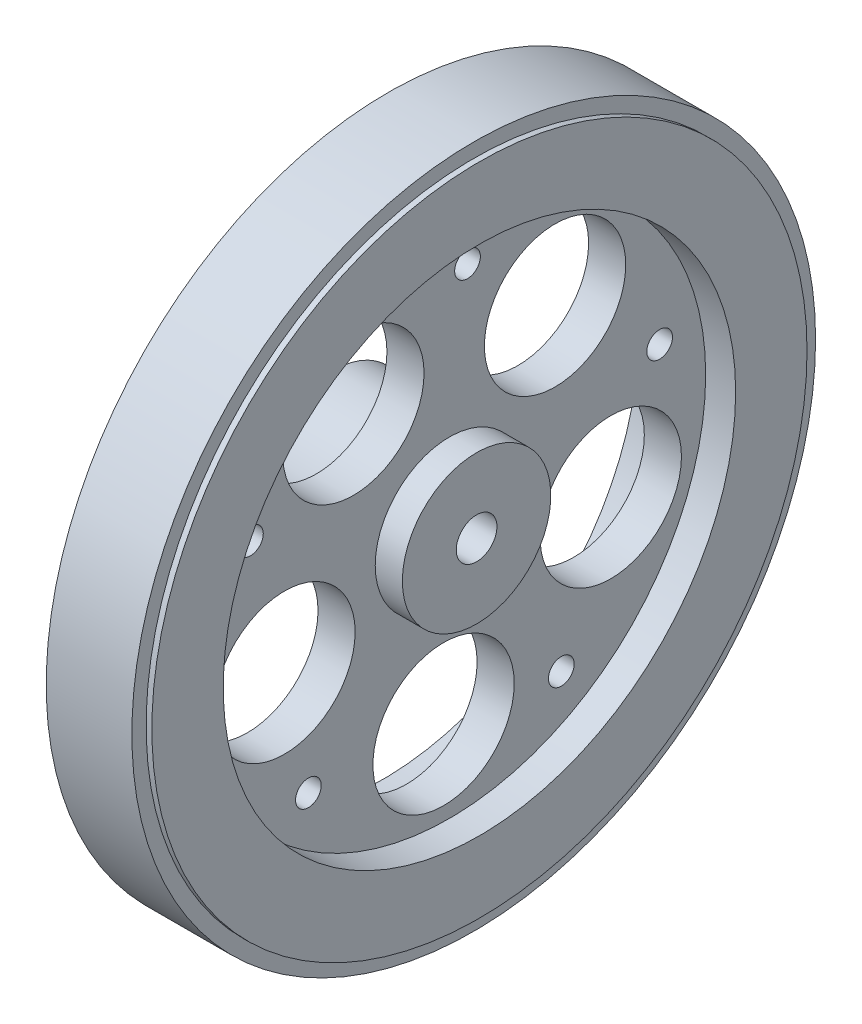
ISO-10303-21;
HEADER;
FILE_DESCRIPTION(('STEP AP214'),'2;1');
FILE_NAME('part.step','',(''),(''),'','','');
FILE_SCHEMA(('AUTOMOTIVE_DESIGN { 1 0 10303 214 1 1 1 1 }'));
ENDSEC;
DATA;
#1=APPLICATION_CONTEXT('core data for automotive mechanical design processes');
#2=APPLICATION_PROTOCOL_DEFINITION('international standard','automotive_design',2000,#1);
#3=PRODUCT_CONTEXT('',#1,'mechanical');
#4=PRODUCT('Part','Part','',(#3));
#5=PRODUCT_RELATED_PRODUCT_CATEGORY('part','',(#4));
#6=PRODUCT_DEFINITION_FORMATION('','',#4);
#7=PRODUCT_DEFINITION_CONTEXT('part definition',#1,'design');
#8=PRODUCT_DEFINITION('design','',#6,#7);
#9=PRODUCT_DEFINITION_SHAPE('','',#8);
#10=(LENGTH_UNIT() NAMED_UNIT(*) SI_UNIT(.MILLI.,.METRE.));
#11=(NAMED_UNIT(*) PLANE_ANGLE_UNIT() SI_UNIT($,.RADIAN.));
#12=(NAMED_UNIT(*) SI_UNIT($,.STERADIAN.) SOLID_ANGLE_UNIT());
#13=UNCERTAINTY_MEASURE_WITH_UNIT(LENGTH_MEASURE(1.E-05),#10,'distance_accuracy_value','');
#14=(GEOMETRIC_REPRESENTATION_CONTEXT(3) GLOBAL_UNCERTAINTY_ASSIGNED_CONTEXT((#13)) GLOBAL_UNIT_ASSIGNED_CONTEXT((#10,
#11,#12)) REPRESENTATION_CONTEXT('',''));
#15=CARTESIAN_POINT('',(0.,0.,0.));
#16=DIRECTION('',(0.,0.,1.));
#17=DIRECTION('',(1.,0.,0.));
#18=AXIS2_PLACEMENT_3D('',#15,#16,#17);
#19=CARTESIAN_POINT('',(2.6,0.,0.));
#20=DIRECTION('',(-1.,0.,0.));
#21=DIRECTION('',(0.,0.,1.));
#22=AXIS2_PLACEMENT_3D('',#19,#20,#21);
#23=CYLINDRICAL_SURFACE('',#22,45.9);
#24=CARTESIAN_POINT('',(-6.8,0.,0.));
#25=DIRECTION('',(1.,0.,0.));
#26=DIRECTION('',(0.,0.,-1.));
#27=AXIS2_PLACEMENT_3D('',#24,#25,#26);
#28=CIRCLE('',#27,45.9);
#29=CARTESIAN_POINT('',(-6.8,0.,-45.9));
#30=VERTEX_POINT('',#29);
#31=EDGE_CURVE('E149',#30,#30,#28,.T.);
#32=ORIENTED_EDGE('',*,*,#31,.T.);
#33=EDGE_LOOP('',(#32));
#34=FACE_BOUND('',#33,.T.);
#35=CARTESIAN_POINT('',(-6.,0.,0.));
#36=DIRECTION('',(1.,0.,0.));
#37=DIRECTION('',(0.,0.,-1.));
#38=AXIS2_PLACEMENT_3D('',#35,#36,#37);
#39=CIRCLE('',#38,45.9);
#40=CARTESIAN_POINT('',(-6.,0.,-45.9));
#41=VERTEX_POINT('',#40);
#42=EDGE_CURVE('E10',#41,#41,#39,.T.);
#43=ORIENTED_EDGE('',*,*,#42,.F.);
#44=EDGE_LOOP('',(#43));
#45=FACE_BOUND('',#44,.T.);
#46=ADVANCED_FACE('F39',(#34,#45),#23,.T.);
#47=CARTESIAN_POINT('',(2.6,0.,0.));
#48=DIRECTION('',(1.,0.,0.));
#49=DIRECTION('',(0.,0.,-1.));
#50=AXIS2_PLACEMENT_3D('',#47,#48,#49);
#51=PLANE('',#50);
#52=CARTESIAN_POINT('',(2.6,30.1440823798759,-2.52918909440491));
#53=DIRECTION('',(1.,0.,0.));
#54=DIRECTION('',(0.,0.,-1.));
#55=AXIS2_PLACEMENT_3D('',#52,#53,#54);
#56=CIRCLE('',#55,1.8);
#57=CARTESIAN_POINT('',(2.6,30.1440823798759,-4.32918909440491));
#58=VERTEX_POINT('',#57);
#59=EDGE_CURVE('E94',#58,#58,#56,.T.);
#60=ORIENTED_EDGE('',*,*,#59,.F.);
#61=EDGE_LOOP('',(#60));
#62=FACE_BOUND('',#61,.T.);
#63=CARTESIAN_POINT('',(2.6,6.90963196604355,-29.4502883872778));
#64=DIRECTION('',(1.,0.,0.));
#65=DIRECTION('',(0.,0.,-1.));
#66=AXIS2_PLACEMENT_3D('',#63,#64,#65);
#67=CIRCLE('',#66,1.8);
#68=CARTESIAN_POINT('',(2.6,6.90963196604355,-31.2502883872778));
#69=VERTEX_POINT('',#68);
#70=EDGE_CURVE('E91',#69,#69,#67,.T.);
#71=ORIENTED_EDGE('',*,*,#70,.F.);
#72=EDGE_LOOP('',(#71));
#73=FACE_BOUND('',#72,.T.);
#74=CARTESIAN_POINT('',(2.6,-25.8736949751082,-15.6720901074189));
#75=DIRECTION('',(1.,0.,0.));
#76=DIRECTION('',(0.,0.,-1.));
#77=AXIS2_PLACEMENT_3D('',#74,#75,#76);
#78=CIRCLE('',#77,1.8);
#79=CARTESIAN_POINT('',(2.6,-25.8736949751082,-17.4720901074189));
#80=VERTEX_POINT('',#79);
#81=EDGE_CURVE('E87',#80,#80,#78,.T.);
#82=ORIENTED_EDGE('',*,*,#81,.F.);
#83=EDGE_LOOP('',(#82));
#84=FACE_BOUND('',#83,.T.);
#85=CARTESIAN_POINT('',(2.6,-22.9004548752077,19.764404026142));
#86=DIRECTION('',(1.,0.,0.));
#87=DIRECTION('',(0.,0.,-1.));
#88=AXIS2_PLACEMENT_3D('',#85,#86,#87);
#89=CIRCLE('',#88,1.8);
#90=CARTESIAN_POINT('',(2.6,-22.9004548752077,17.964404026142));
#91=VERTEX_POINT('',#90);
#92=EDGE_CURVE('E83',#91,#91,#89,.T.);
#93=ORIENTED_EDGE('',*,*,#92,.F.);
#94=EDGE_LOOP('',(#93));
#95=FACE_BOUND('',#94,.T.);
#96=CARTESIAN_POINT('',(2.6,11.7204355043968,27.8871635629598));
#97=DIRECTION('',(1.,0.,0.));
#98=DIRECTION('',(0.,0.,-1.));
#99=AXIS2_PLACEMENT_3D('',#96,#97,#98);
#100=CIRCLE('',#99,1.8);
#101=CARTESIAN_POINT('',(2.6,11.7204355043968,26.0871635629598));
#102=VERTEX_POINT('',#101);
#103=EDGE_CURVE('E79',#102,#102,#100,.T.);
#104=ORIENTED_EDGE('',*,*,#103,.F.);
#105=EDGE_LOOP('',(#104));
#106=FACE_BOUND('',#105,.T.);
#107=CARTESIAN_POINT('',(2.6,-6.64204065665267,23.1146229888219));
#108=DIRECTION('',(1.,0.,0.));
#109=DIRECTION('',(0.,0.,-1.));
#110=AXIS2_PLACEMENT_3D('',#107,#108,#109);
#111=CIRCLE('',#110,9.9);
#112=CARTESIAN_POINT('',(2.6,-6.64204065665267,13.2146229888219));
#113=VERTEX_POINT('',#112);
#114=EDGE_CURVE('E75',#113,#113,#111,.T.);
#115=ORIENTED_EDGE('',*,*,#114,.F.);
#116=EDGE_LOOP('',(#115));
#117=FACE_BOUND('',#116,.T.);
#118=CARTESIAN_POINT('',(2.6,-24.0358162554598,0.825855274108885));
#119=DIRECTION('',(1.,0.,0.));
#120=DIRECTION('',(0.,0.,-1.));
#121=AXIS2_PLACEMENT_3D('',#118,#119,#120);
#122=CIRCLE('',#121,9.9);
#123=CARTESIAN_POINT('',(2.6,-24.0358162554598,-9.07414472589112));
#124=VERTEX_POINT('',#123);
#125=EDGE_CURVE('E71',#124,#124,#122,.T.);
#126=ORIENTED_EDGE('',*,*,#125,.F.);
#127=EDGE_LOOP('',(#126));
#128=FACE_BOUND('',#127,.T.);
#129=CARTESIAN_POINT('',(2.6,-8.2129107365686,-22.6042163596342));
#130=DIRECTION('',(1.,0.,0.));
#131=DIRECTION('',(0.,0.,-1.));
#132=AXIS2_PLACEMENT_3D('',#129,#130,#131);
#133=CIRCLE('',#132,9.9);
#134=CARTESIAN_POINT('',(2.6,-8.2129107365686,-32.5042163596342));
#135=VERTEX_POINT('',#134);
#136=EDGE_CURVE('E67',#135,#135,#133,.T.);
#137=ORIENTED_EDGE('',*,*,#136,.F.);
#138=EDGE_LOOP('',(#137));
#139=FACE_BOUND('',#138,.T.);
#140=CARTESIAN_POINT('',(2.6,18.9599582736915,-14.7960292734191));
#141=DIRECTION('',(1.,0.,0.));
#142=DIRECTION('',(0.,0.,-1.));
#143=AXIS2_PLACEMENT_3D('',#140,#141,#142);
#144=CIRCLE('',#143,9.9);
#145=CARTESIAN_POINT('',(2.6,18.9599582736915,-24.6960292734191));
#146=VERTEX_POINT('',#145);
#147=EDGE_CURVE('E63',#146,#146,#144,.T.);
#148=ORIENTED_EDGE('',*,*,#147,.F.);
#149=EDGE_LOOP('',(#148));
#150=FACE_BOUND('',#149,.T.);
#151=CARTESIAN_POINT('',(2.6,19.9308093749896,13.4597673701229));
#152=DIRECTION('',(1.,0.,0.));
#153=DIRECTION('',(0.,0.,-1.));
#154=AXIS2_PLACEMENT_3D('',#151,#152,#153);
#155=CIRCLE('',#154,9.9);
#156=CARTESIAN_POINT('',(2.6,19.9308093749896,3.55976737012288));
#157=VERTEX_POINT('',#156);
#158=EDGE_CURVE('E62',#157,#157,#155,.T.);
#159=ORIENTED_EDGE('',*,*,#158,.F.);
#160=EDGE_LOOP('',(#159));
#161=FACE_BOUND('',#160,.T.);
#162=CARTESIAN_POINT('',(2.6,0.,0.));
#163=DIRECTION('',(1.,0.,0.));
#164=DIRECTION('',(0.,0.,-1.));
#165=AXIS2_PLACEMENT_3D('',#162,#163,#164);
#166=CIRCLE('',#165,35.9);
#167=CARTESIAN_POINT('',(2.6,0.,-35.9));
#168=VERTEX_POINT('',#167);
#169=EDGE_CURVE('E50',#168,#168,#166,.F.);
#170=ORIENTED_EDGE('',*,*,#169,.F.);
#171=EDGE_LOOP('',(#170));
#172=FACE_BOUND('',#171,.T.);
#173=CARTESIAN_POINT('',(2.6,0.,0.));
#174=DIRECTION('',(1.,0.,0.));
#175=DIRECTION('',(0.,0.,-1.));
#176=AXIS2_PLACEMENT_3D('',#173,#174,#175);
#177=CIRCLE('',#176,10.4);
#178=CARTESIAN_POINT('',(2.6,0.,10.4));
#179=VERTEX_POINT('',#178);
#180=EDGE_CURVE('E133',#179,#179,#177,.T.);
#181=ORIENTED_EDGE('',*,*,#180,.F.);
#182=EDGE_LOOP('',(#181));
#183=FACE_BOUND('',#182,.T.);
#184=ADVANCED_FACE('F179',(#62,#73,#84,#95,#106,#117,#128,#139,#150,#161,#172,#183),#51,.T.);
#185=CARTESIAN_POINT('',(-2.6,0.,0.));
#186=DIRECTION('',(1.,0.,0.));
#187=DIRECTION('',(0.,0.,-1.));
#188=AXIS2_PLACEMENT_3D('',#185,#186,#187);
#189=PLANE('',#188);
#190=CARTESIAN_POINT('',(-2.6,30.1440823798759,-2.52918909440491));
#191=DIRECTION('',(1.,0.,0.));
#192=DIRECTION('',(0.,0.,-1.));
#193=AXIS2_PLACEMENT_3D('',#190,#191,#192);
#194=CIRCLE('',#193,1.8);
#195=CARTESIAN_POINT('',(-2.6,30.1440823798759,-4.32918909440491));
#196=VERTEX_POINT('',#195);
#197=EDGE_CURVE('E95',#196,#196,#194,.T.);
#198=ORIENTED_EDGE('',*,*,#197,.T.);
#199=EDGE_LOOP('',(#198));
#200=FACE_BOUND('',#199,.T.);
#201=CARTESIAN_POINT('',(-2.6,6.90963196604355,-29.4502883872778));
#202=DIRECTION('',(1.,0.,0.));
#203=DIRECTION('',(0.,0.,-1.));
#204=AXIS2_PLACEMENT_3D('',#201,#202,#203);
#205=CIRCLE('',#204,1.8);
#206=CARTESIAN_POINT('',(-2.6,6.90963196604355,-31.2502883872778));
#207=VERTEX_POINT('',#206);
#208=EDGE_CURVE('E92',#207,#207,#205,.T.);
#209=ORIENTED_EDGE('',*,*,#208,.T.);
#210=EDGE_LOOP('',(#209));
#211=FACE_BOUND('',#210,.T.);
#212=CARTESIAN_POINT('',(-2.6,-25.8736949751082,-15.6720901074189));
#213=DIRECTION('',(1.,0.,0.));
#214=DIRECTION('',(0.,0.,-1.));
#215=AXIS2_PLACEMENT_3D('',#212,#213,#214);
#216=CIRCLE('',#215,1.8);
#217=CARTESIAN_POINT('',(-2.6,-25.8736949751082,-17.4720901074189));
#218=VERTEX_POINT('',#217);
#219=EDGE_CURVE('E88',#218,#218,#216,.T.);
#220=ORIENTED_EDGE('',*,*,#219,.T.);
#221=EDGE_LOOP('',(#220));
#222=FACE_BOUND('',#221,.T.);
#223=CARTESIAN_POINT('',(-2.6,-22.9004548752077,19.764404026142));
#224=DIRECTION('',(1.,0.,0.));
#225=DIRECTION('',(0.,0.,-1.));
#226=AXIS2_PLACEMENT_3D('',#223,#224,#225);
#227=CIRCLE('',#226,1.8);
#228=CARTESIAN_POINT('',(-2.6,-22.9004548752077,17.964404026142));
#229=VERTEX_POINT('',#228);
#230=EDGE_CURVE('E84',#229,#229,#227,.T.);
#231=ORIENTED_EDGE('',*,*,#230,.T.);
#232=EDGE_LOOP('',(#231));
#233=FACE_BOUND('',#232,.T.);
#234=CARTESIAN_POINT('',(-2.6,11.7204355043968,27.8871635629598));
#235=DIRECTION('',(1.,0.,0.));
#236=DIRECTION('',(0.,0.,-1.));
#237=AXIS2_PLACEMENT_3D('',#234,#235,#236);
#238=CIRCLE('',#237,1.8);
#239=CARTESIAN_POINT('',(-2.6,11.7204355043968,26.0871635629598));
#240=VERTEX_POINT('',#239);
#241=EDGE_CURVE('E80',#240,#240,#238,.T.);
#242=ORIENTED_EDGE('',*,*,#241,.T.);
#243=EDGE_LOOP('',(#242));
#244=FACE_BOUND('',#243,.T.);
#245=CARTESIAN_POINT('',(-2.6,-6.64204065665267,23.1146229888219));
#246=DIRECTION('',(1.,0.,0.));
#247=DIRECTION('',(0.,0.,-1.));
#248=AXIS2_PLACEMENT_3D('',#245,#246,#247);
#249=CIRCLE('',#248,9.9);
#250=CARTESIAN_POINT('',(-2.6,-6.64204065665267,13.2146229888219));
#251=VERTEX_POINT('',#250);
#252=EDGE_CURVE('E76',#251,#251,#249,.T.);
#253=ORIENTED_EDGE('',*,*,#252,.T.);
#254=EDGE_LOOP('',(#253));
#255=FACE_BOUND('',#254,.T.);
#256=CARTESIAN_POINT('',(-2.6,-24.0358162554598,0.825855274108885));
#257=DIRECTION('',(1.,0.,0.));
#258=DIRECTION('',(0.,0.,-1.));
#259=AXIS2_PLACEMENT_3D('',#256,#257,#258);
#260=CIRCLE('',#259,9.9);
#261=CARTESIAN_POINT('',(-2.6,-24.0358162554598,-9.07414472589112));
#262=VERTEX_POINT('',#261);
#263=EDGE_CURVE('E72',#262,#262,#260,.T.);
#264=ORIENTED_EDGE('',*,*,#263,.T.);
#265=EDGE_LOOP('',(#264));
#266=FACE_BOUND('',#265,.T.);
#267=CARTESIAN_POINT('',(-2.6,-8.2129107365686,-22.6042163596342));
#268=DIRECTION('',(1.,0.,0.));
#269=DIRECTION('',(0.,0.,-1.));
#270=AXIS2_PLACEMENT_3D('',#267,#268,#269);
#271=CIRCLE('',#270,9.9);
#272=CARTESIAN_POINT('',(-2.6,-8.2129107365686,-32.5042163596342));
#273=VERTEX_POINT('',#272);
#274=EDGE_CURVE('E68',#273,#273,#271,.T.);
#275=ORIENTED_EDGE('',*,*,#274,.T.);
#276=EDGE_LOOP('',(#275));
#277=FACE_BOUND('',#276,.T.);
#278=CARTESIAN_POINT('',(-2.6,18.9599582736915,-14.7960292734191));
#279=DIRECTION('',(1.,0.,0.));
#280=DIRECTION('',(0.,0.,-1.));
#281=AXIS2_PLACEMENT_3D('',#278,#279,#280);
#282=CIRCLE('',#281,9.9);
#283=CARTESIAN_POINT('',(-2.6,18.9599582736915,-24.6960292734191));
#284=VERTEX_POINT('',#283);
#285=EDGE_CURVE('E64',#284,#284,#282,.T.);
#286=ORIENTED_EDGE('',*,*,#285,.T.);
#287=EDGE_LOOP('',(#286));
#288=FACE_BOUND('',#287,.T.);
#289=CARTESIAN_POINT('',(-2.6,19.9308093749896,13.4597673701229));
#290=DIRECTION('',(1.,0.,0.));
#291=DIRECTION('',(0.,0.,-1.));
#292=AXIS2_PLACEMENT_3D('',#289,#290,#291);
#293=CIRCLE('',#292,9.9);
#294=CARTESIAN_POINT('',(-2.6,19.9308093749896,3.55976737012288));
#295=VERTEX_POINT('',#294);
#296=EDGE_CURVE('E59',#295,#295,#293,.T.);
#297=ORIENTED_EDGE('',*,*,#296,.T.);
#298=EDGE_LOOP('',(#297));
#299=FACE_BOUND('',#298,.T.);
#300=CARTESIAN_POINT('',(-2.6,0.,0.));
#301=DIRECTION('',(1.,0.,0.));
#302=DIRECTION('',(0.,0.,-1.));
#303=AXIS2_PLACEMENT_3D('',#300,#301,#302);
#304=CIRCLE('',#303,35.9);
#305=CARTESIAN_POINT('',(-2.6,0.,-35.9));
#306=VERTEX_POINT('',#305);
#307=EDGE_CURVE('E55',#306,#306,#304,.F.);
#308=ORIENTED_EDGE('',*,*,#307,.T.);
#309=EDGE_LOOP('',(#308));
#310=FACE_BOUND('',#309,.T.);
#311=CARTESIAN_POINT('',(-2.6,0.,0.));
#312=DIRECTION('',(1.,0.,0.));
#313=DIRECTION('',(0.,0.,-1.));
#314=AXIS2_PLACEMENT_3D('',#311,#312,#313);
#315=CIRCLE('',#314,10.4);
#316=CARTESIAN_POINT('',(-2.6,0.,-10.4));
#317=VERTEX_POINT('',#316);
#318=EDGE_CURVE('E46',#317,#317,#315,.F.);
#319=ORIENTED_EDGE('',*,*,#318,.F.);
#320=EDGE_LOOP('',(#319));
#321=FACE_BOUND('',#320,.T.);
#322=ADVANCED_FACE('F175',(#200,#211,#222,#233,#244,#255,#266,#277,#288,#299,#310,#321),#189,.F.);
#323=CARTESIAN_POINT('',(6.8,0.,0.));
#324=DIRECTION('',(1.,0.,0.));
#325=DIRECTION('',(0.,0.,-1.));
#326=AXIS2_PLACEMENT_3D('',#323,#324,#325);
#327=PLANE('',#326);
#328=CARTESIAN_POINT('',(6.8,0.,0.));
#329=DIRECTION('',(1.,0.,0.));
#330=DIRECTION('',(0.,0.,-1.));
#331=AXIS2_PLACEMENT_3D('',#328,#329,#330);
#332=CIRCLE('',#331,45.9);
#333=CARTESIAN_POINT('',(6.8,0.,-45.9));
#334=VERTEX_POINT('',#333);
#335=EDGE_CURVE('E152',#334,#334,#332,.T.);
#336=ORIENTED_EDGE('',*,*,#335,.T.);
#337=EDGE_LOOP('',(#336));
#338=FACE_BOUND('',#337,.T.);
#339=CARTESIAN_POINT('',(6.8,0.,0.));
#340=DIRECTION('',(1.,0.,0.));
#341=DIRECTION('',(0.,0.,-1.));
#342=AXIS2_PLACEMENT_3D('',#339,#340,#341);
#343=CIRCLE('',#342,35.9);
#344=CARTESIAN_POINT('',(6.8,0.,-35.9));
#345=VERTEX_POINT('',#344);
#346=EDGE_CURVE('E146',#345,#345,#343,.T.);
#347=ORIENTED_EDGE('',*,*,#346,.F.);
#348=EDGE_LOOP('',(#347));
#349=FACE_BOUND('',#348,.T.);
#350=ADVANCED_FACE('F178',(#338,#349),#327,.T.);
#351=CARTESIAN_POINT('',(6.8,0.,0.));
#352=DIRECTION('',(-1.,0.,0.));
#353=DIRECTION('',(0.,0.,1.));
#354=AXIS2_PLACEMENT_3D('',#351,#352,#353);
#355=CYLINDRICAL_SURFACE('',#354,35.9);
#356=ORIENTED_EDGE('',*,*,#169,.T.);
#357=EDGE_LOOP('',(#356));
#358=FACE_BOUND('',#357,.T.);
#359=ORIENTED_EDGE('',*,*,#346,.T.);
#360=EDGE_LOOP('',(#359));
#361=FACE_BOUND('',#360,.T.);
#362=ADVANCED_FACE('F171',(#358,#361),#355,.F.);
#363=CARTESIAN_POINT('',(6.,0.,0.));
#364=DIRECTION('',(1.,0.,0.));
#365=DIRECTION('',(0.,0.,-1.));
#366=AXIS2_PLACEMENT_3D('',#363,#364,#365);
#367=CIRCLE('',#366,45.9);
#368=CARTESIAN_POINT('',(6.,0.,-45.9));
#369=VERTEX_POINT('',#368);
#370=EDGE_CURVE('E108',#369,#369,#367,.T.);
#371=ORIENTED_EDGE('',*,*,#370,.T.);
#372=EDGE_LOOP('',(#371));
#373=FACE_BOUND('',#372,.T.);
#374=ORIENTED_EDGE('',*,*,#335,.F.);
#375=EDGE_LOOP('',(#374));
#376=FACE_BOUND('',#375,.T.);
#377=ADVANCED_FACE('F41',(#373,#376),#23,.T.);
#378=CARTESIAN_POINT('',(-6.8,0.,0.));
#379=DIRECTION('',(1.,0.,0.));
#380=DIRECTION('',(0.,0.,-1.));
#381=AXIS2_PLACEMENT_3D('',#378,#379,#380);
#382=PLANE('',#381);
#383=ORIENTED_EDGE('',*,*,#31,.F.);
#384=EDGE_LOOP('',(#383));
#385=FACE_BOUND('',#384,.T.);
#386=CARTESIAN_POINT('',(-6.8,0.,0.));
#387=DIRECTION('',(1.,0.,0.));
#388=DIRECTION('',(0.,0.,-1.));
#389=AXIS2_PLACEMENT_3D('',#386,#387,#388);
#390=CIRCLE('',#389,35.9);
#391=CARTESIAN_POINT('',(-6.8,0.,-35.9));
#392=VERTEX_POINT('',#391);
#393=EDGE_CURVE('E145',#392,#392,#390,.T.);
#394=ORIENTED_EDGE('',*,*,#393,.T.);
#395=EDGE_LOOP('',(#394));
#396=FACE_BOUND('',#395,.T.);
#397=ADVANCED_FACE('F160',(#385,#396),#382,.F.);
#398=ORIENTED_EDGE('',*,*,#393,.F.);
#399=EDGE_LOOP('',(#398));
#400=FACE_BOUND('',#399,.T.);
#401=ORIENTED_EDGE('',*,*,#307,.F.);
#402=EDGE_LOOP('',(#401));
#403=FACE_BOUND('',#402,.T.);
#404=ADVANCED_FACE('F163',(#400,#403),#355,.F.);
#405=CARTESIAN_POINT('',(-6.8,0.,0.));
#406=DIRECTION('',(1.,0.,0.));
#407=DIRECTION('',(0.,0.,-1.));
#408=AXIS2_PLACEMENT_3D('',#405,#406,#407);
#409=CYLINDRICAL_SURFACE('',#408,2.85);
#410=CARTESIAN_POINT('',(-13.6,0.,0.));
#411=DIRECTION('',(-1.,0.,0.));
#412=DIRECTION('',(0.,0.,1.));
#413=AXIS2_PLACEMENT_3D('',#410,#411,#412);
#414=CIRCLE('',#413,2.85);
#415=CARTESIAN_POINT('',(-13.6,0.,2.85));
#416=VERTEX_POINT('',#415);
#417=EDGE_CURVE('E137',#416,#416,#414,.T.);
#418=ORIENTED_EDGE('',*,*,#417,.T.);
#419=EDGE_LOOP('',(#418));
#420=FACE_BOUND('',#419,.T.);
#421=CARTESIAN_POINT('',(6.4,0.,0.));
#422=DIRECTION('',(1.,0.,0.));
#423=DIRECTION('',(0.,0.,-1.));
#424=AXIS2_PLACEMENT_3D('',#421,#422,#423);
#425=CIRCLE('',#424,2.85);
#426=CARTESIAN_POINT('',(6.4,0.,-2.85));
#427=VERTEX_POINT('',#426);
#428=EDGE_CURVE('E130',#427,#427,#425,.T.);
#429=ORIENTED_EDGE('',*,*,#428,.T.);
#430=EDGE_LOOP('',(#429));
#431=FACE_BOUND('',#430,.T.);
#432=ADVANCED_FACE('F169',(#420,#431),#409,.F.);
#433=CARTESIAN_POINT('',(-13.6,0.,0.));
#434=DIRECTION('',(-1.,0.,0.));
#435=DIRECTION('',(0.,0.,1.));
#436=AXIS2_PLACEMENT_3D('',#433,#434,#435);
#437=PLANE('',#436);
#438=CARTESIAN_POINT('',(-13.6,0.,0.));
#439=DIRECTION('',(-1.,0.,0.));
#440=DIRECTION('',(0.,0.,1.));
#441=AXIS2_PLACEMENT_3D('',#438,#439,#440);
#442=CIRCLE('',#441,10.4);
#443=CARTESIAN_POINT('',(-13.6,0.,10.4));
#444=VERTEX_POINT('',#443);
#445=EDGE_CURVE('E142',#444,#444,#442,.T.);
#446=ORIENTED_EDGE('',*,*,#445,.T.);
#447=EDGE_LOOP('',(#446));
#448=FACE_BOUND('',#447,.T.);
#449=ORIENTED_EDGE('',*,*,#417,.F.);
#450=EDGE_LOOP('',(#449));
#451=FACE_BOUND('',#450,.T.);
#452=ADVANCED_FACE('F269',(#448,#451),#437,.T.);
#453=CARTESIAN_POINT('',(-13.6,0.,0.));
#454=DIRECTION('',(1.,0.,0.));
#455=DIRECTION('',(0.,0.,-1.));
#456=AXIS2_PLACEMENT_3D('',#453,#454,#455);
#457=CYLINDRICAL_SURFACE('',#456,10.4);
#458=ORIENTED_EDGE('',*,*,#445,.F.);
#459=EDGE_LOOP('',(#458));
#460=FACE_BOUND('',#459,.T.);
#461=ORIENTED_EDGE('',*,*,#318,.T.);
#462=EDGE_LOOP('',(#461));
#463=FACE_BOUND('',#462,.T.);
#464=ADVANCED_FACE('F264',(#460,#463),#457,.T.);
#465=CARTESIAN_POINT('',(6.4,0.,0.));
#466=DIRECTION('',(1.,0.,0.));
#467=DIRECTION('',(0.,0.,-1.));
#468=AXIS2_PLACEMENT_3D('',#465,#466,#467);
#469=PLANE('',#468);
#470=CARTESIAN_POINT('',(6.4,0.,0.));
#471=DIRECTION('',(1.,0.,0.));
#472=DIRECTION('',(0.,0.,-1.));
#473=AXIS2_PLACEMENT_3D('',#470,#471,#472);
#474=CIRCLE('',#473,10.4);
#475=CARTESIAN_POINT('',(6.4,0.,10.4));
#476=VERTEX_POINT('',#475);
#477=EDGE_CURVE('E134',#476,#476,#474,.T.);
#478=ORIENTED_EDGE('',*,*,#477,.T.);
#479=EDGE_LOOP('',(#478));
#480=FACE_BOUND('',#479,.T.);
#481=ORIENTED_EDGE('',*,*,#428,.F.);
#482=EDGE_LOOP('',(#481));
#483=FACE_BOUND('',#482,.T.);
#484=ADVANCED_FACE('F261',(#480,#483),#469,.T.);
#485=CARTESIAN_POINT('',(6.4,0.,0.));
#486=DIRECTION('',(-1.,0.,0.));
#487=DIRECTION('',(0.,0.,1.));
#488=AXIS2_PLACEMENT_3D('',#485,#486,#487);
#489=CYLINDRICAL_SURFACE('',#488,10.4);
#490=CARTESIAN_POINT('',(6.4,0.,10.4));
#491=CARTESIAN_POINT('',(6.36041666666667,0.,10.4));
#492=CARTESIAN_POINT('',(6.32083333333333,0.,10.4));
#493=CARTESIAN_POINT('',(6.24166666666667,0.,10.4));
#494=CARTESIAN_POINT('',(6.20208333333333,0.,10.4));
#495=CARTESIAN_POINT('',(6.12291666666667,0.,10.4));
#496=CARTESIAN_POINT('',(6.08333333333333,0.,10.4));
#497=CARTESIAN_POINT('',(6.00416666666667,0.,10.4));
#498=CARTESIAN_POINT('',(5.96458333333333,0.,10.4));
#499=CARTESIAN_POINT('',(5.88541666666667,0.,10.4));
#500=CARTESIAN_POINT('',(5.84583333333333,0.,10.4));
#501=CARTESIAN_POINT('',(5.76666666666667,0.,10.4));
#502=CARTESIAN_POINT('',(5.72708333333333,0.,10.4));
#503=CARTESIAN_POINT('',(5.64791666666667,0.,10.4));
#504=CARTESIAN_POINT('',(5.60833333333333,0.,10.4));
#505=CARTESIAN_POINT('',(5.52916666666667,0.,10.4));
#506=CARTESIAN_POINT('',(5.48958333333333,0.,10.4));
#507=CARTESIAN_POINT('',(5.41041666666667,0.,10.4));
#508=CARTESIAN_POINT('',(5.37083333333333,0.,10.4));
#509=CARTESIAN_POINT('',(5.29166666666667,0.,10.4));
#510=CARTESIAN_POINT('',(5.25208333333333,0.,10.4));
#511=CARTESIAN_POINT('',(5.17291666666667,0.,10.4));
#512=CARTESIAN_POINT('',(5.13333333333333,0.,10.4));
#513=CARTESIAN_POINT('',(5.05416666666667,0.,10.4));
#514=CARTESIAN_POINT('',(5.01458333333333,0.,10.4));
#515=CARTESIAN_POINT('',(4.93541666666667,0.,10.4));
#516=CARTESIAN_POINT('',(4.89583333333333,0.,10.4));
#517=CARTESIAN_POINT('',(4.81666666666667,0.,10.4));
#518=CARTESIAN_POINT('',(4.77708333333333,0.,10.4));
#519=CARTESIAN_POINT('',(4.69791666666667,0.,10.4));
#520=CARTESIAN_POINT('',(4.65833333333333,0.,10.4));
#521=CARTESIAN_POINT('',(4.57916666666667,0.,10.4));
#522=CARTESIAN_POINT('',(4.53958333333333,0.,10.4));
#523=CARTESIAN_POINT('',(4.46041666666667,0.,10.4));
#524=CARTESIAN_POINT('',(4.42083333333333,0.,10.4));
#525=CARTESIAN_POINT('',(4.34166666666667,0.,10.4));
#526=CARTESIAN_POINT('',(4.30208333333333,0.,10.4));
#527=CARTESIAN_POINT('',(4.22291666666667,0.,10.4));
#528=CARTESIAN_POINT('',(4.18333333333333,0.,10.4));
#529=CARTESIAN_POINT('',(4.10416666666667,0.,10.4));
#530=CARTESIAN_POINT('',(4.06458333333333,0.,10.4));
#531=CARTESIAN_POINT('',(3.98541666666667,0.,10.4));
#532=CARTESIAN_POINT('',(3.94583333333333,0.,10.4));
#533=CARTESIAN_POINT('',(3.86666666666667,0.,10.4));
#534=CARTESIAN_POINT('',(3.82708333333333,0.,10.4));
#535=CARTESIAN_POINT('',(3.74791666666667,0.,10.4));
#536=CARTESIAN_POINT('',(3.70833333333333,0.,10.4));
#537=CARTESIAN_POINT('',(3.62916666666667,0.,10.4));
#538=CARTESIAN_POINT('',(3.58958333333333,0.,10.4));
#539=CARTESIAN_POINT('',(3.51041666666667,0.,10.4));
#540=CARTESIAN_POINT('',(3.47083333333333,0.,10.4));
#541=CARTESIAN_POINT('',(3.39166666666667,0.,10.4));
#542=CARTESIAN_POINT('',(3.35208333333333,0.,10.4));
#543=CARTESIAN_POINT('',(3.27291666666667,0.,10.4));
#544=CARTESIAN_POINT('',(3.23333333333333,0.,10.4));
#545=CARTESIAN_POINT('',(3.15416666666667,0.,10.4));
#546=CARTESIAN_POINT('',(3.11458333333333,0.,10.4));
#547=CARTESIAN_POINT('',(3.03541666666667,0.,10.4));
#548=CARTESIAN_POINT('',(2.99583333333333,0.,10.4));
#549=CARTESIAN_POINT('',(2.91666666666667,0.,10.4));
#550=CARTESIAN_POINT('',(2.87708333333333,0.,10.4));
#551=CARTESIAN_POINT('',(2.79791666666667,0.,10.4));
#552=CARTESIAN_POINT('',(2.75833333333333,0.,10.4));
#553=CARTESIAN_POINT('',(2.67916666666667,0.,10.4));
#554=CARTESIAN_POINT('',(2.63958333333333,0.,10.4));
#555=CARTESIAN_POINT('',(2.6,0.,10.4));
#556=B_SPLINE_CURVE_WITH_KNOTS('',3,(#490,#491,#492,#493,#494,#495,#496,#497,#498,#499,#500,
#501,#502,#503,#504,#505,#506,#507,#508,#509,#510,#511,#512,#513,#514,#515,#516,#517,#518,#519,
#520,#521,#522,#523,#524,#525,#526,#527,#528,#529,#530,#531,#532,#533,#534,#535,#536,#537,#538,
#539,#540,#541,#542,#543,#544,#545,#546,#547,#548,#549,#550,#551,#552,#553,#554,#555),
.UNSPECIFIED.,.F.,.F.,(4,2,2,2,2,2,2,2,2,2,2,2,2,2,2,2,2,2,2,2,2,2,2,2,2,2,2,2,2,2,2,2,4),(0.,
0.118750000000001,0.237500000000001,0.356250000000001,0.475000000000001,0.593750000000001,
0.7125,0.83125,0.95,1.06875,1.1875,1.30625,1.425,1.54375,1.6625,1.78125,1.9,2.01875,2.1375,
2.25625,2.375,2.49375,2.6125,2.73125,2.85,2.96875,3.0875,3.20625,3.325,3.44375,3.5625,3.68125,
3.8),.UNSPECIFIED.);
#557=EDGE_CURVE('BSEAM259',#476,#179,#556,.T.);
#558=ORIENTED_EDGE('',*,*,#477,.F.);
#559=ORIENTED_EDGE('',*,*,#180,.T.);
#560=ORIENTED_EDGE('',*,*,#557,.T.);
#561=ORIENTED_EDGE('',*,*,#557,.F.);
#562=EDGE_LOOP('',(#558,#560,#559,#561));
#563=FACE_BOUND('',#562,.T.);
#564=ADVANCED_FACE('F259',(#563),#489,.T.);
#565=CARTESIAN_POINT('',(-13.6,19.9308093749896,13.4597673701229));
#566=DIRECTION('',(1.,0.,0.));
#567=DIRECTION('',(0.,0.,-1.));
#568=AXIS2_PLACEMENT_3D('',#565,#566,#567);
#569=CYLINDRICAL_SURFACE('',#568,9.9);
#570=ORIENTED_EDGE('',*,*,#158,.T.);
#571=EDGE_LOOP('',(#570));
#572=FACE_BOUND('',#571,.T.);
#573=ORIENTED_EDGE('',*,*,#296,.F.);
#574=EDGE_LOOP('',(#573));
#575=FACE_BOUND('',#574,.T.);
#576=ADVANCED_FACE('F255',(#572,#575),#569,.F.);
#577=CARTESIAN_POINT('',(-13.6,18.9599582736915,-14.7960292734191));
#578=DIRECTION('',(1.,0.,0.));
#579=DIRECTION('',(0.,0.,-1.));
#580=AXIS2_PLACEMENT_3D('',#577,#578,#579);
#581=CYLINDRICAL_SURFACE('',#580,9.9);
#582=ORIENTED_EDGE('',*,*,#147,.T.);
#583=EDGE_LOOP('',(#582));
#584=FACE_BOUND('',#583,.T.);
#585=ORIENTED_EDGE('',*,*,#285,.F.);
#586=EDGE_LOOP('',(#585));
#587=FACE_BOUND('',#586,.T.);
#588=ADVANCED_FACE('F251',(#584,#587),#581,.F.);
#589=CARTESIAN_POINT('',(-13.6,-8.2129107365686,-22.6042163596342));
#590=DIRECTION('',(1.,0.,0.));
#591=DIRECTION('',(0.,0.,-1.));
#592=AXIS2_PLACEMENT_3D('',#589,#590,#591);
#593=CYLINDRICAL_SURFACE('',#592,9.9);
#594=ORIENTED_EDGE('',*,*,#136,.T.);
#595=EDGE_LOOP('',(#594));
#596=FACE_BOUND('',#595,.T.);
#597=ORIENTED_EDGE('',*,*,#274,.F.);
#598=EDGE_LOOP('',(#597));
#599=FACE_BOUND('',#598,.T.);
#600=ADVANCED_FACE('F247',(#596,#599),#593,.F.);
#601=CARTESIAN_POINT('',(-13.6,-24.0358162554598,0.825855274108885));
#602=DIRECTION('',(1.,0.,0.));
#603=DIRECTION('',(0.,0.,-1.));
#604=AXIS2_PLACEMENT_3D('',#601,#602,#603);
#605=CYLINDRICAL_SURFACE('',#604,9.9);
#606=ORIENTED_EDGE('',*,*,#125,.T.);
#607=EDGE_LOOP('',(#606));
#608=FACE_BOUND('',#607,.T.);
#609=ORIENTED_EDGE('',*,*,#263,.F.);
#610=EDGE_LOOP('',(#609));
#611=FACE_BOUND('',#610,.T.);
#612=ADVANCED_FACE('F243',(#608,#611),#605,.F.);
#613=CARTESIAN_POINT('',(-13.6,-6.64204065665267,23.1146229888219));
#614=DIRECTION('',(1.,0.,0.));
#615=DIRECTION('',(0.,0.,-1.));
#616=AXIS2_PLACEMENT_3D('',#613,#614,#615);
#617=CYLINDRICAL_SURFACE('',#616,9.9);
#618=ORIENTED_EDGE('',*,*,#114,.T.);
#619=EDGE_LOOP('',(#618));
#620=FACE_BOUND('',#619,.T.);
#621=ORIENTED_EDGE('',*,*,#252,.F.);
#622=EDGE_LOOP('',(#621));
#623=FACE_BOUND('',#622,.T.);
#624=ADVANCED_FACE('F239',(#620,#623),#617,.F.);
#625=CARTESIAN_POINT('',(-13.6,11.7204355043968,27.8871635629598));
#626=DIRECTION('',(1.,0.,0.));
#627=DIRECTION('',(0.,0.,-1.));
#628=AXIS2_PLACEMENT_3D('',#625,#626,#627);
#629=CYLINDRICAL_SURFACE('',#628,1.8);
#630=ORIENTED_EDGE('',*,*,#103,.T.);
#631=EDGE_LOOP('',(#630));
#632=FACE_BOUND('',#631,.T.);
#633=ORIENTED_EDGE('',*,*,#241,.F.);
#634=EDGE_LOOP('',(#633));
#635=FACE_BOUND('',#634,.T.);
#636=ADVANCED_FACE('F235',(#632,#635),#629,.F.);
#637=CARTESIAN_POINT('',(-13.6,-22.9004548752077,19.764404026142));
#638=DIRECTION('',(1.,0.,0.));
#639=DIRECTION('',(0.,0.,-1.));
#640=AXIS2_PLACEMENT_3D('',#637,#638,#639);
#641=CYLINDRICAL_SURFACE('',#640,1.8);
#642=ORIENTED_EDGE('',*,*,#92,.T.);
#643=EDGE_LOOP('',(#642));
#644=FACE_BOUND('',#643,.T.);
#645=ORIENTED_EDGE('',*,*,#230,.F.);
#646=EDGE_LOOP('',(#645));
#647=FACE_BOUND('',#646,.T.);
#648=ADVANCED_FACE('F231',(#644,#647),#641,.F.);
#649=CARTESIAN_POINT('',(-13.6,-25.8736949751082,-15.6720901074189));
#650=DIRECTION('',(1.,0.,0.));
#651=DIRECTION('',(0.,0.,-1.));
#652=AXIS2_PLACEMENT_3D('',#649,#650,#651);
#653=CYLINDRICAL_SURFACE('',#652,1.8);
#654=ORIENTED_EDGE('',*,*,#81,.T.);
#655=EDGE_LOOP('',(#654));
#656=FACE_BOUND('',#655,.T.);
#657=ORIENTED_EDGE('',*,*,#219,.F.);
#658=EDGE_LOOP('',(#657));
#659=FACE_BOUND('',#658,.T.);
#660=ADVANCED_FACE('F227',(#656,#659),#653,.F.);
#661=CARTESIAN_POINT('',(-13.6,6.90963196604355,-29.4502883872778));
#662=DIRECTION('',(1.,0.,0.));
#663=DIRECTION('',(0.,0.,-1.));
#664=AXIS2_PLACEMENT_3D('',#661,#662,#663);
#665=CYLINDRICAL_SURFACE('',#664,1.8);
#666=ORIENTED_EDGE('',*,*,#70,.T.);
#667=EDGE_LOOP('',(#666));
#668=FACE_BOUND('',#667,.T.);
#669=ORIENTED_EDGE('',*,*,#208,.F.);
#670=EDGE_LOOP('',(#669));
#671=FACE_BOUND('',#670,.T.);
#672=ADVANCED_FACE('F218',(#668,#671),#665,.F.);
#673=CARTESIAN_POINT('',(-13.6,30.1440823798759,-2.52918909440491));
#674=DIRECTION('',(1.,0.,0.));
#675=DIRECTION('',(0.,0.,-1.));
#676=AXIS2_PLACEMENT_3D('',#673,#674,#675);
#677=CYLINDRICAL_SURFACE('',#676,1.8);
#678=ORIENTED_EDGE('',*,*,#59,.T.);
#679=EDGE_LOOP('',(#678));
#680=FACE_BOUND('',#679,.T.);
#681=ORIENTED_EDGE('',*,*,#197,.F.);
#682=EDGE_LOOP('',(#681));
#683=FACE_BOUND('',#682,.T.);
#684=ADVANCED_FACE('F209',(#680,#683),#677,.F.);
#685=CARTESIAN_POINT('',(6.,0.,0.));
#686=DIRECTION('',(1.,0.,0.));
#687=DIRECTION('',(0.,0.,-1.));
#688=AXIS2_PLACEMENT_3D('',#685,#686,#687);
#689=PLANE('',#688);
#690=CARTESIAN_POINT('',(6.,0.,0.));
#691=DIRECTION('',(1.,0.,0.));
#692=DIRECTION('',(0.,0.,-1.));
#693=AXIS2_PLACEMENT_3D('',#690,#691,#692);
#694=CIRCLE('',#693,47.9);
#695=CARTESIAN_POINT('',(6.,0.,-47.9));
#696=VERTEX_POINT('',#695);
#697=EDGE_CURVE('E97',#696,#696,#694,.T.);
#698=ORIENTED_EDGE('',*,*,#697,.T.);
#699=EDGE_LOOP('',(#698));
#700=FACE_BOUND('',#699,.T.);
#701=ORIENTED_EDGE('',*,*,#370,.F.);
#702=EDGE_LOOP('',(#701));
#703=FACE_BOUND('',#702,.T.);
#704=ADVANCED_FACE('F206',(#700,#703),#689,.T.);
#705=CARTESIAN_POINT('',(-6.,0.,0.));
#706=DIRECTION('',(1.,0.,0.));
#707=DIRECTION('',(0.,0.,-1.));
#708=AXIS2_PLACEMENT_3D('',#705,#706,#707);
#709=PLANE('',#708);
#710=CARTESIAN_POINT('',(-6.,0.,0.));
#711=DIRECTION('',(1.,0.,0.));
#712=DIRECTION('',(0.,0.,-1.));
#713=AXIS2_PLACEMENT_3D('',#710,#711,#712);
#714=CIRCLE('',#713,47.9);
#715=CARTESIAN_POINT('',(-6.,0.,-47.9));
#716=VERTEX_POINT('',#715);
#717=EDGE_CURVE('E103',#716,#716,#714,.T.);
#718=ORIENTED_EDGE('',*,*,#717,.F.);
#719=EDGE_LOOP('',(#718));
#720=FACE_BOUND('',#719,.T.);
#721=ORIENTED_EDGE('',*,*,#42,.T.);
#722=EDGE_LOOP('',(#721));
#723=FACE_BOUND('',#722,.T.);
#724=ADVANCED_FACE('F208',(#720,#723),#709,.F.);
#725=CARTESIAN_POINT('',(6.,0.,0.));
#726=DIRECTION('',(-1.,0.,0.));
#727=DIRECTION('',(0.,0.,1.));
#728=AXIS2_PLACEMENT_3D('',#725,#726,#727);
#729=CYLINDRICAL_SURFACE('',#728,47.9);
#730=ORIENTED_EDGE('',*,*,#697,.F.);
#731=EDGE_LOOP('',(#730));
#732=FACE_BOUND('',#731,.T.);
#733=ORIENTED_EDGE('',*,*,#717,.T.);
#734=EDGE_LOOP('',(#733));
#735=FACE_BOUND('',#734,.T.);
#736=ADVANCED_FACE('F215',(#732,#735),#729,.T.);
#737=CLOSED_SHELL('',(#46,#184,#322,#350,#362,#377,#397,#404,#432,#452,#464,#484,#564,#576,#588,
#600,#612,#624,#636,#648,#660,#672,#684,#704,#724,#736));
#738=MANIFOLD_SOLID_BREP('B2',#737);
#739=ADVANCED_BREP_SHAPE_REPRESENTATION('',(#18,#738),#14);
#740=SHAPE_DEFINITION_REPRESENTATION(#9,#739);
ENDSEC;
END-ISO-10303-21;
